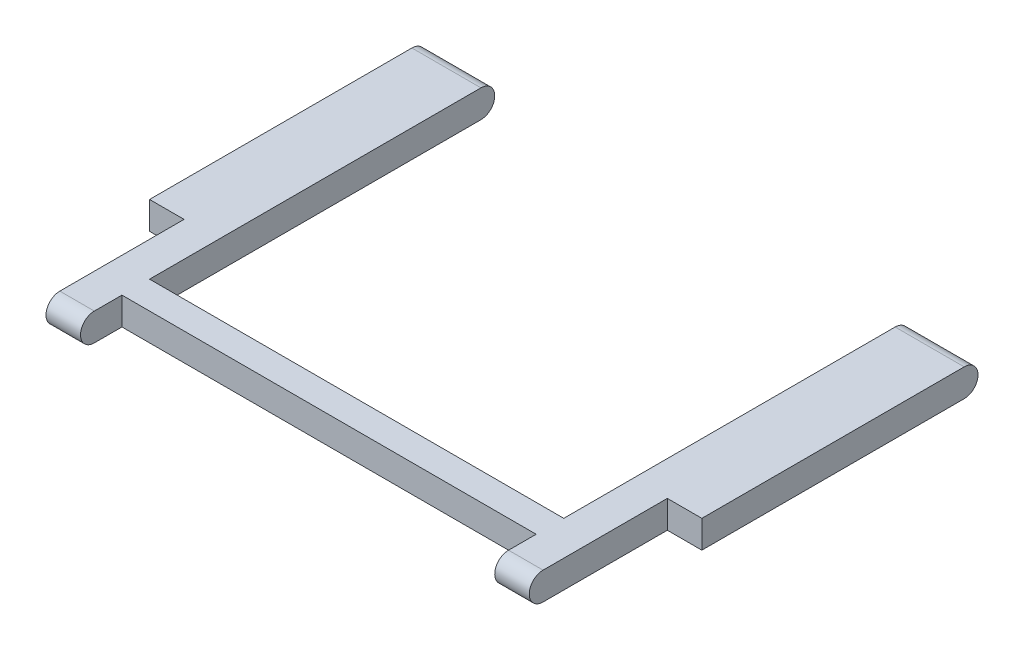
ISO-10303-21;
HEADER;
FILE_DESCRIPTION(('STEP AP214'),'2;1');
FILE_NAME('part.step','',(''),(''),'','','');
FILE_SCHEMA(('AUTOMOTIVE_DESIGN { 1 0 10303 214 1 1 1 1 }'));
ENDSEC;
DATA;
#1=APPLICATION_CONTEXT('core data for automotive mechanical design processes');
#2=APPLICATION_PROTOCOL_DEFINITION('international standard','automotive_design',2000,#1);
#3=PRODUCT_CONTEXT('',#1,'mechanical');
#4=PRODUCT('Part','Part','',(#3));
#5=PRODUCT_RELATED_PRODUCT_CATEGORY('part','',(#4));
#6=PRODUCT_DEFINITION_FORMATION('','',#4);
#7=PRODUCT_DEFINITION_CONTEXT('part definition',#1,'design');
#8=PRODUCT_DEFINITION('design','',#6,#7);
#9=PRODUCT_DEFINITION_SHAPE('','',#8);
#10=(LENGTH_UNIT() NAMED_UNIT(*) SI_UNIT(.MILLI.,.METRE.));
#11=(NAMED_UNIT(*) PLANE_ANGLE_UNIT() SI_UNIT($,.RADIAN.));
#12=(NAMED_UNIT(*) SI_UNIT($,.STERADIAN.) SOLID_ANGLE_UNIT());
#13=UNCERTAINTY_MEASURE_WITH_UNIT(LENGTH_MEASURE(1.E-05),#10,'distance_accuracy_value','');
#14=(GEOMETRIC_REPRESENTATION_CONTEXT(3) GLOBAL_UNCERTAINTY_ASSIGNED_CONTEXT((#13)) GLOBAL_UNIT_ASSIGNED_CONTEXT((#10,
#11,#12)) REPRESENTATION_CONTEXT('',''));
#15=CARTESIAN_POINT('',(0.,0.,0.));
#16=DIRECTION('',(0.,0.,1.));
#17=DIRECTION('',(1.,0.,0.));
#18=AXIS2_PLACEMENT_3D('',#15,#16,#17);
#19=CARTESIAN_POINT('',(80.,0.,28.));
#20=DIRECTION('',(-1.,0.,0.));
#21=DIRECTION('',(0.,0.,1.));
#22=AXIS2_PLACEMENT_3D('',#19,#20,#21);
#23=CYLINDRICAL_SURFACE('',#22,2.);
#24=DIRECTION('',(-1.,0.,0.));
#25=VECTOR('',#24,1.);
#26=CARTESIAN_POINT('',(80.,2.,28.));
#27=LINE('',#26,#25);
#28=CARTESIAN_POINT('',(10.,2.,28.));
#29=VERTEX_POINT('',#28);
#30=CARTESIAN_POINT('',(5.00000000000001,2.,28.));
#31=VERTEX_POINT('',#30);
#32=EDGE_CURVE('E246',#29,#31,#27,.T.);
#33=ORIENTED_EDGE('',*,*,#32,.T.);
#34=CARTESIAN_POINT('',(5.00000000000002,0.,28.));
#35=DIRECTION('',(1.,0.,0.));
#36=DIRECTION('',(0.,0.,-1.));
#37=AXIS2_PLACEMENT_3D('',#34,#35,#36);
#38=CIRCLE('',#37,2.);
#39=CARTESIAN_POINT('',(5.00000000000002,-2.,28.));
#40=VERTEX_POINT('',#39);
#41=EDGE_CURVE('E161',#31,#40,#38,.T.);
#42=ORIENTED_EDGE('',*,*,#41,.T.);
#43=DIRECTION('',(-1.,0.,0.));
#44=VECTOR('',#43,1.);
#45=CARTESIAN_POINT('',(80.,-2.,28.));
#46=LINE('',#45,#44);
#47=CARTESIAN_POINT('',(10.,-2.,28.));
#48=VERTEX_POINT('',#47);
#49=EDGE_CURVE('E262',#48,#40,#46,.T.);
#50=ORIENTED_EDGE('',*,*,#49,.F.);
#51=CARTESIAN_POINT('',(10.,0.,28.));
#52=DIRECTION('',(-1.,0.,0.));
#53=DIRECTION('',(0.,0.,1.));
#54=AXIS2_PLACEMENT_3D('',#51,#52,#53);
#55=CIRCLE('',#54,2.);
#56=EDGE_CURVE('E235',#48,#29,#55,.T.);
#57=ORIENTED_EDGE('',*,*,#56,.T.);
#58=EDGE_LOOP('',(#33,#42,#50,#57));
#59=FACE_BOUND('',#58,.T.);
#60=ADVANCED_FACE('F38',(#59),#23,.T.);
#61=CARTESIAN_POINT('',(80.,0.,-28.));
#62=DIRECTION('',(-1.,0.,0.));
#63=DIRECTION('',(0.,0.,1.));
#64=AXIS2_PLACEMENT_3D('',#61,#62,#63);
#65=CYLINDRICAL_SURFACE('',#64,2.);
#66=DIRECTION('',(-1.,0.,0.));
#67=VECTOR('',#66,1.);
#68=CARTESIAN_POINT('',(80.,2.00000000000001,-28.));
#69=LINE('',#68,#67);
#70=CARTESIAN_POINT('',(10.,2.00000000000001,-28.));
#71=VERTEX_POINT('',#70);
#72=CARTESIAN_POINT('',(0.,2.00000000000001,-28.));
#73=VERTEX_POINT('',#72);
#74=EDGE_CURVE('E254',#71,#73,#69,.T.);
#75=ORIENTED_EDGE('',*,*,#74,.F.);
#76=CARTESIAN_POINT('',(9.99999999999999,0.,-28.));
#77=DIRECTION('',(-1.,0.,0.));
#78=DIRECTION('',(0.,0.,1.));
#79=AXIS2_PLACEMENT_3D('',#76,#77,#78);
#80=CIRCLE('',#79,2.);
#81=CARTESIAN_POINT('',(9.99999999999999,-1.99999999999999,-28.));
#82=VERTEX_POINT('',#81);
#83=EDGE_CURVE('E217',#71,#82,#80,.T.);
#84=ORIENTED_EDGE('',*,*,#83,.T.);
#85=DIRECTION('',(-1.,0.,0.));
#86=VECTOR('',#85,1.);
#87=CARTESIAN_POINT('',(80.,-1.99999999999999,-28.));
#88=LINE('',#87,#86);
#89=CARTESIAN_POINT('',(0.,-1.99999999999999,-28.));
#90=VERTEX_POINT('',#89);
#91=EDGE_CURVE('E258',#82,#90,#88,.T.);
#92=ORIENTED_EDGE('',*,*,#91,.T.);
#93=CARTESIAN_POINT('',(0.,0.,-28.));
#94=DIRECTION('',(1.,0.,0.));
#95=DIRECTION('',(0.,0.,-1.));
#96=AXIS2_PLACEMENT_3D('',#93,#94,#95);
#97=CIRCLE('',#96,2.);
#98=EDGE_CURVE('E248',#90,#73,#97,.T.);
#99=ORIENTED_EDGE('',*,*,#98,.T.);
#100=EDGE_LOOP('',(#75,#84,#92,#99));
#101=FACE_BOUND('',#100,.T.);
#102=ADVANCED_FACE('F324',(#101),#65,.T.);
#103=CARTESIAN_POINT('',(75.,0.,28.));
#104=DIRECTION('',(-1.,0.,0.));
#105=DIRECTION('',(0.,0.,1.));
#106=AXIS2_PLACEMENT_3D('',#103,#104,#105);
#107=CIRCLE('',#106,2.);
#108=CARTESIAN_POINT('',(75.,-2.,28.));
#109=VERTEX_POINT('',#108);
#110=CARTESIAN_POINT('',(75.,2.,28.));
#111=VERTEX_POINT('',#110);
#112=EDGE_CURVE('E185',#109,#111,#107,.T.);
#113=ORIENTED_EDGE('',*,*,#112,.T.);
#114=CARTESIAN_POINT('',(70.,2.,28.));
#115=VERTEX_POINT('',#114);
#116=EDGE_CURVE('E252',#111,#115,#27,.T.);
#117=ORIENTED_EDGE('',*,*,#116,.T.);
#118=CARTESIAN_POINT('',(70.,0.,28.));
#119=DIRECTION('',(1.,0.,0.));
#120=DIRECTION('',(0.,0.,-1.));
#121=AXIS2_PLACEMENT_3D('',#118,#119,#120);
#122=CIRCLE('',#121,2.);
#123=CARTESIAN_POINT('',(70.,-2.,28.));
#124=VERTEX_POINT('',#123);
#125=EDGE_CURVE('E226',#115,#124,#122,.T.);
#126=ORIENTED_EDGE('',*,*,#125,.T.);
#127=EDGE_CURVE('E263',#109,#124,#46,.T.);
#128=ORIENTED_EDGE('',*,*,#127,.F.);
#129=EDGE_LOOP('',(#113,#117,#126,#128));
#130=FACE_BOUND('',#129,.T.);
#131=ADVANCED_FACE('F40',(#130),#23,.T.);
#132=CARTESIAN_POINT('',(80.,-2.,28.));
#133=DIRECTION('',(0.,1.,0.));
#134=DIRECTION('',(0.,0.,1.));
#135=AXIS2_PLACEMENT_3D('',#132,#133,#134);
#136=PLANE('',#135);
#137=DIRECTION('',(0.,0.,-1.));
#138=VECTOR('',#137,1.);
#139=CARTESIAN_POINT('',(5.00000000000002,-2.,28.));
#140=LINE('',#139,#138);
#141=CARTESIAN_POINT('',(5.00000000000001,-2.,10.));
#142=VERTEX_POINT('',#141);
#143=EDGE_CURVE('E187',#40,#142,#140,.T.);
#144=ORIENTED_EDGE('',*,*,#143,.T.);
#145=DIRECTION('',(-1.,0.,0.));
#146=VECTOR('',#145,1.);
#147=CARTESIAN_POINT('',(80.,-2.,9.99999999999999));
#148=LINE('',#147,#146);
#149=CARTESIAN_POINT('',(0.,-2.,10.));
#150=VERTEX_POINT('',#149);
#151=EDGE_CURVE('E153',#142,#150,#148,.T.);
#152=ORIENTED_EDGE('',*,*,#151,.T.);
#153=DIRECTION('',(0.,0.,-1.));
#154=VECTOR('',#153,1.);
#155=CARTESIAN_POINT('',(0.,-2.,28.));
#156=LINE('',#155,#154);
#157=EDGE_CURVE('E238',#150,#90,#156,.T.);
#158=ORIENTED_EDGE('',*,*,#157,.T.);
#159=ORIENTED_EDGE('',*,*,#91,.F.);
#160=DIRECTION('',(0.,0.,1.));
#161=VECTOR('',#160,1.);
#162=CARTESIAN_POINT('',(10.,-2.,28.));
#163=LINE('',#162,#161);
#164=CARTESIAN_POINT('',(10.,-2.,20.));
#165=VERTEX_POINT('',#164);
#166=EDGE_CURVE('E220',#82,#165,#163,.T.);
#167=ORIENTED_EDGE('',*,*,#166,.T.);
#168=DIRECTION('',(1.,0.,0.));
#169=VECTOR('',#168,1.);
#170=CARTESIAN_POINT('',(80.,-2.,20.));
#171=LINE('',#170,#169);
#172=CARTESIAN_POINT('',(70.,-2.,20.));
#173=VERTEX_POINT('',#172);
#174=EDGE_CURVE('E200',#165,#173,#171,.T.);
#175=ORIENTED_EDGE('',*,*,#174,.T.);
#176=DIRECTION('',(0.,0.,-1.));
#177=VECTOR('',#176,1.);
#178=CARTESIAN_POINT('',(70.,-2.,28.));
#179=LINE('',#178,#177);
#180=CARTESIAN_POINT('',(70.,-1.99999999999999,-28.));
#181=VERTEX_POINT('',#180);
#182=EDGE_CURVE('E214',#173,#181,#179,.T.);
#183=ORIENTED_EDGE('',*,*,#182,.T.);
#184=CARTESIAN_POINT('',(80.,-1.99999999999999,-28.));
#185=VERTEX_POINT('',#184);
#186=EDGE_CURVE('E259',#185,#181,#88,.T.);
#187=ORIENTED_EDGE('',*,*,#186,.F.);
#188=DIRECTION('',(0.,0.,-1.));
#189=VECTOR('',#188,1.);
#190=CARTESIAN_POINT('',(80.,-2.,28.));
#191=LINE('',#190,#189);
#192=CARTESIAN_POINT('',(80.,-2.,10.));
#193=VERTEX_POINT('',#192);
#194=EDGE_CURVE('E239',#193,#185,#191,.T.);
#195=ORIENTED_EDGE('',*,*,#194,.F.);
#196=DIRECTION('',(-1.,0.,0.));
#197=VECTOR('',#196,1.);
#198=CARTESIAN_POINT('',(80.,-2.,9.99999999999999));
#199=LINE('',#198,#197);
#200=CARTESIAN_POINT('',(75.,-2.,10.));
#201=VERTEX_POINT('',#200);
#202=EDGE_CURVE('E52',#193,#201,#199,.T.);
#203=ORIENTED_EDGE('',*,*,#202,.T.);
#204=DIRECTION('',(0.,0.,1.));
#205=VECTOR('',#204,1.);
#206=CARTESIAN_POINT('',(75.,-2.,28.));
#207=LINE('',#206,#205);
#208=EDGE_CURVE('E182',#201,#109,#207,.T.);
#209=ORIENTED_EDGE('',*,*,#208,.T.);
#210=ORIENTED_EDGE('',*,*,#127,.T.);
#211=DIRECTION('',(0.,0.,-1.));
#212=VECTOR('',#211,1.);
#213=CARTESIAN_POINT('',(70.,-2.,28.));
#214=LINE('',#213,#212);
#215=CARTESIAN_POINT('',(70.,-2.,24.));
#216=VERTEX_POINT('',#215);
#217=EDGE_CURVE('E223',#124,#216,#214,.T.);
#218=ORIENTED_EDGE('',*,*,#217,.T.);
#219=DIRECTION('',(-1.,0.,0.));
#220=VECTOR('',#219,1.);
#221=CARTESIAN_POINT('',(80.,-2.,24.));
#222=LINE('',#221,#220);
#223=CARTESIAN_POINT('',(10.,-2.,24.));
#224=VERTEX_POINT('',#223);
#225=EDGE_CURVE('E229',#216,#224,#222,.T.);
#226=ORIENTED_EDGE('',*,*,#225,.T.);
#227=DIRECTION('',(0.,0.,1.));
#228=VECTOR('',#227,1.);
#229=CARTESIAN_POINT('',(10.,-2.,28.));
#230=LINE('',#229,#228);
#231=EDGE_CURVE('E232',#224,#48,#230,.T.);
#232=ORIENTED_EDGE('',*,*,#231,.T.);
#233=ORIENTED_EDGE('',*,*,#49,.T.);
#234=EDGE_LOOP('',(#144,#152,#158,#159,#167,#175,#183,#187,#195,#203,#209,#210,#218,#226,#232,#233));
#235=FACE_BOUND('',#234,.T.);
#236=ADVANCED_FACE('F275',(#235),#136,.F.);
#237=ORIENTED_EDGE('',*,*,#186,.T.);
#238=CARTESIAN_POINT('',(70.,0.,-28.));
#239=DIRECTION('',(1.,0.,0.));
#240=DIRECTION('',(0.,0.,-1.));
#241=AXIS2_PLACEMENT_3D('',#238,#239,#240);
#242=CIRCLE('',#241,2.);
#243=CARTESIAN_POINT('',(70.,2.00000000000001,-28.));
#244=VERTEX_POINT('',#243);
#245=EDGE_CURVE('E211',#181,#244,#242,.T.);
#246=ORIENTED_EDGE('',*,*,#245,.T.);
#247=CARTESIAN_POINT('',(80.,2.00000000000001,-28.));
#248=VERTEX_POINT('',#247);
#249=EDGE_CURVE('E255',#248,#244,#69,.T.);
#250=ORIENTED_EDGE('',*,*,#249,.F.);
#251=CARTESIAN_POINT('',(80.,0.,-28.));
#252=DIRECTION('',(1.,0.,0.));
#253=DIRECTION('',(0.,0.,-1.));
#254=AXIS2_PLACEMENT_3D('',#251,#252,#253);
#255=CIRCLE('',#254,2.);
#256=EDGE_CURVE('E241',#185,#248,#255,.T.);
#257=ORIENTED_EDGE('',*,*,#256,.F.);
#258=EDGE_LOOP('',(#237,#246,#250,#257));
#259=FACE_BOUND('',#258,.T.);
#260=ADVANCED_FACE('F310',(#259),#65,.T.);
#261=CARTESIAN_POINT('',(80.,2.,28.));
#262=DIRECTION('',(0.,-1.,0.));
#263=DIRECTION('',(0.,0.,-1.));
#264=AXIS2_PLACEMENT_3D('',#261,#262,#263);
#265=PLANE('',#264);
#266=DIRECTION('',(0.,0.,1.));
#267=VECTOR('',#266,1.);
#268=CARTESIAN_POINT('',(0.,2.,28.));
#269=LINE('',#268,#267);
#270=CARTESIAN_POINT('',(0.,2.,10.));
#271=VERTEX_POINT('',#270);
#272=EDGE_CURVE('E170',#73,#271,#269,.T.);
#273=ORIENTED_EDGE('',*,*,#272,.T.);
#274=DIRECTION('',(-1.,0.,0.));
#275=VECTOR('',#274,1.);
#276=CARTESIAN_POINT('',(0.,2.,10.));
#277=LINE('',#276,#275);
#278=CARTESIAN_POINT('',(5.00000000000001,2.,10.));
#279=VERTEX_POINT('',#278);
#280=EDGE_CURVE('E60',#279,#271,#277,.T.);
#281=ORIENTED_EDGE('',*,*,#280,.F.);
#282=DIRECTION('',(0.,0.,-1.));
#283=VECTOR('',#282,1.);
#284=CARTESIAN_POINT('',(5.00000000000001,2.,30.));
#285=LINE('',#284,#283);
#286=EDGE_CURVE('E159',#31,#279,#285,.T.);
#287=ORIENTED_EDGE('',*,*,#286,.F.);
#288=ORIENTED_EDGE('',*,*,#32,.F.);
#289=DIRECTION('',(0.,0.,1.));
#290=VECTOR('',#289,1.);
#291=CARTESIAN_POINT('',(10.,2.,40.0549506934379));
#292=LINE('',#291,#290);
#293=CARTESIAN_POINT('',(10.,2.,24.));
#294=VERTEX_POINT('',#293);
#295=EDGE_CURVE('E191',#294,#29,#292,.T.);
#296=ORIENTED_EDGE('',*,*,#295,.F.);
#297=DIRECTION('',(-1.,0.,0.));
#298=VECTOR('',#297,1.);
#299=CARTESIAN_POINT('',(10.,2.,24.));
#300=LINE('',#299,#298);
#301=CARTESIAN_POINT('',(70.,2.,24.));
#302=VERTEX_POINT('',#301);
#303=EDGE_CURVE('E193',#302,#294,#300,.T.);
#304=ORIENTED_EDGE('',*,*,#303,.F.);
#305=DIRECTION('',(0.,0.,1.));
#306=VECTOR('',#305,1.);
#307=CARTESIAN_POINT('',(70.,2.,28.));
#308=LINE('',#307,#306);
#309=EDGE_CURVE('E268',#302,#115,#308,.T.);
#310=ORIENTED_EDGE('',*,*,#309,.T.);
#311=ORIENTED_EDGE('',*,*,#116,.F.);
#312=DIRECTION('',(0.,0.,1.));
#313=VECTOR('',#312,1.);
#314=CARTESIAN_POINT('',(75.,2.,30.));
#315=LINE('',#314,#313);
#316=CARTESIAN_POINT('',(75.,2.,10.));
#317=VERTEX_POINT('',#316);
#318=EDGE_CURVE('E176',#317,#111,#315,.T.);
#319=ORIENTED_EDGE('',*,*,#318,.F.);
#320=DIRECTION('',(-1.,0.,0.));
#321=VECTOR('',#320,1.);
#322=CARTESIAN_POINT('',(80.,2.,10.));
#323=LINE('',#322,#321);
#324=CARTESIAN_POINT('',(80.,2.,10.));
#325=VERTEX_POINT('',#324);
#326=EDGE_CURVE('E173',#325,#317,#323,.T.);
#327=ORIENTED_EDGE('',*,*,#326,.F.);
#328=DIRECTION('',(0.,0.,1.));
#329=VECTOR('',#328,1.);
#330=CARTESIAN_POINT('',(80.,2.,28.));
#331=LINE('',#330,#329);
#332=EDGE_CURVE('E243',#248,#325,#331,.T.);
#333=ORIENTED_EDGE('',*,*,#332,.F.);
#334=ORIENTED_EDGE('',*,*,#249,.T.);
#335=DIRECTION('',(0.,0.,-1.));
#336=VECTOR('',#335,1.);
#337=CARTESIAN_POINT('',(70.,2.00000000000001,-36.9603432624808));
#338=LINE('',#337,#336);
#339=CARTESIAN_POINT('',(70.,2.,20.));
#340=VERTEX_POINT('',#339);
#341=EDGE_CURVE('E204',#340,#244,#338,.T.);
#342=ORIENTED_EDGE('',*,*,#341,.F.);
#343=DIRECTION('',(1.,0.,0.));
#344=VECTOR('',#343,1.);
#345=CARTESIAN_POINT('',(10.,2.,20.));
#346=LINE('',#345,#344);
#347=CARTESIAN_POINT('',(10.,2.,20.));
#348=VERTEX_POINT('',#347);
#349=EDGE_CURVE('E190',#348,#340,#346,.T.);
#350=ORIENTED_EDGE('',*,*,#349,.F.);
#351=DIRECTION('',(0.,0.,-1.));
#352=VECTOR('',#351,1.);
#353=CARTESIAN_POINT('',(10.,2.,28.));
#354=LINE('',#353,#352);
#355=EDGE_CURVE('E265',#348,#71,#354,.T.);
#356=ORIENTED_EDGE('',*,*,#355,.T.);
#357=ORIENTED_EDGE('',*,*,#74,.T.);
#358=EDGE_LOOP('',(#273,#281,#287,#288,#296,#304,#310,#311,#319,#327,#333,#334,#342,#350,#356,#357));
#359=FACE_BOUND('',#358,.T.);
#360=ADVANCED_FACE('F168',(#359),#265,.F.);
#361=CARTESIAN_POINT('',(80.,0.,28.));
#362=DIRECTION('',(1.,0.,0.));
#363=DIRECTION('',(0.,0.,-1.));
#364=AXIS2_PLACEMENT_3D('',#361,#362,#363);
#365=PLANE('',#364);
#366=DIRECTION('',(0.,1.,0.));
#367=VECTOR('',#366,1.);
#368=CARTESIAN_POINT('',(80.,0.,9.99999999999999));
#369=LINE('',#368,#367);
#370=EDGE_CURVE('E11',#193,#325,#369,.T.);
#371=ORIENTED_EDGE('',*,*,#370,.F.);
#372=ORIENTED_EDGE('',*,*,#194,.T.);
#373=ORIENTED_EDGE('',*,*,#256,.T.);
#374=ORIENTED_EDGE('',*,*,#332,.T.);
#375=EDGE_LOOP('',(#371,#372,#373,#374));
#376=FACE_BOUND('',#375,.T.);
#377=ADVANCED_FACE('F304',(#376),#365,.T.);
#378=CARTESIAN_POINT('',(0.,0.,28.));
#379=DIRECTION('',(1.,0.,0.));
#380=DIRECTION('',(0.,0.,-1.));
#381=AXIS2_PLACEMENT_3D('',#378,#379,#380);
#382=PLANE('',#381);
#383=ORIENTED_EDGE('',*,*,#157,.F.);
#384=DIRECTION('',(0.,1.,0.));
#385=VECTOR('',#384,1.);
#386=CARTESIAN_POINT('',(0.,0.,9.99999999999999));
#387=LINE('',#386,#385);
#388=EDGE_CURVE('E46',#150,#271,#387,.T.);
#389=ORIENTED_EDGE('',*,*,#388,.T.);
#390=ORIENTED_EDGE('',*,*,#272,.F.);
#391=ORIENTED_EDGE('',*,*,#98,.F.);
#392=EDGE_LOOP('',(#383,#389,#390,#391));
#393=FACE_BOUND('',#392,.T.);
#394=ADVANCED_FACE('F272',(#393),#382,.F.);
#395=CARTESIAN_POINT('',(10.,-7.99999999999999,-36.9603432624808));
#396=DIRECTION('',(-1.,0.,0.));
#397=DIRECTION('',(0.,0.,1.));
#398=AXIS2_PLACEMENT_3D('',#395,#396,#397);
#399=PLANE('',#398);
#400=ORIENTED_EDGE('',*,*,#83,.F.);
#401=ORIENTED_EDGE('',*,*,#355,.F.);
#402=DIRECTION('',(0.,1.,0.));
#403=VECTOR('',#402,1.);
#404=CARTESIAN_POINT('',(10.,-8.,20.));
#405=LINE('',#404,#403);
#406=EDGE_CURVE('E206',#165,#348,#405,.T.);
#407=ORIENTED_EDGE('',*,*,#406,.F.);
#408=ORIENTED_EDGE('',*,*,#166,.F.);
#409=EDGE_LOOP('',(#400,#401,#407,#408));
#410=FACE_BOUND('',#409,.T.);
#411=ADVANCED_FACE('F321',(#410),#399,.F.);
#412=CARTESIAN_POINT('',(70.,-7.99999999999999,-36.9603432624808));
#413=DIRECTION('',(1.,0.,0.));
#414=DIRECTION('',(0.,0.,-1.));
#415=AXIS2_PLACEMENT_3D('',#412,#413,#414);
#416=PLANE('',#415);
#417=DIRECTION('',(0.,1.,0.));
#418=VECTOR('',#417,1.);
#419=CARTESIAN_POINT('',(70.,-8.,20.));
#420=LINE('',#419,#418);
#421=EDGE_CURVE('E194',#173,#340,#420,.T.);
#422=ORIENTED_EDGE('',*,*,#421,.T.);
#423=ORIENTED_EDGE('',*,*,#341,.T.);
#424=ORIENTED_EDGE('',*,*,#245,.F.);
#425=ORIENTED_EDGE('',*,*,#182,.F.);
#426=EDGE_LOOP('',(#422,#423,#424,#425));
#427=FACE_BOUND('',#426,.T.);
#428=ADVANCED_FACE('F314',(#427),#416,.F.);
#429=CARTESIAN_POINT('',(10.,-8.,20.));
#430=DIRECTION('',(0.,0.,1.));
#431=DIRECTION('',(0.,-1.,0.));
#432=AXIS2_PLACEMENT_3D('',#429,#430,#431);
#433=PLANE('',#432);
#434=ORIENTED_EDGE('',*,*,#406,.T.);
#435=ORIENTED_EDGE('',*,*,#349,.T.);
#436=ORIENTED_EDGE('',*,*,#421,.F.);
#437=ORIENTED_EDGE('',*,*,#174,.F.);
#438=EDGE_LOOP('',(#434,#435,#436,#437));
#439=FACE_BOUND('',#438,.T.);
#440=ADVANCED_FACE('F317',(#439),#433,.F.);
#441=CARTESIAN_POINT('',(10.,-8.,40.0549506934379));
#442=DIRECTION('',(-1.,0.,0.));
#443=DIRECTION('',(0.,0.,1.));
#444=AXIS2_PLACEMENT_3D('',#441,#442,#443);
#445=PLANE('',#444);
#446=ORIENTED_EDGE('',*,*,#231,.F.);
#447=DIRECTION('',(0.,1.,0.));
#448=VECTOR('',#447,1.);
#449=CARTESIAN_POINT('',(10.,-8.,24.));
#450=LINE('',#449,#448);
#451=EDGE_CURVE('E198',#224,#294,#450,.T.);
#452=ORIENTED_EDGE('',*,*,#451,.T.);
#453=ORIENTED_EDGE('',*,*,#295,.T.);
#454=ORIENTED_EDGE('',*,*,#56,.F.);
#455=EDGE_LOOP('',(#446,#452,#453,#454));
#456=FACE_BOUND('',#455,.T.);
#457=ADVANCED_FACE('F284',(#456),#445,.F.);
#458=CARTESIAN_POINT('',(10.,-8.,24.));
#459=DIRECTION('',(0.,0.,-1.));
#460=DIRECTION('',(0.,1.,0.));
#461=AXIS2_PLACEMENT_3D('',#458,#459,#460);
#462=PLANE('',#461);
#463=DIRECTION('',(0.,1.,0.));
#464=VECTOR('',#463,1.);
#465=CARTESIAN_POINT('',(70.,-8.,24.));
#466=LINE('',#465,#464);
#467=EDGE_CURVE('E197',#216,#302,#466,.T.);
#468=ORIENTED_EDGE('',*,*,#467,.T.);
#469=ORIENTED_EDGE('',*,*,#303,.T.);
#470=ORIENTED_EDGE('',*,*,#451,.F.);
#471=ORIENTED_EDGE('',*,*,#225,.F.);
#472=EDGE_LOOP('',(#468,#469,#470,#471));
#473=FACE_BOUND('',#472,.T.);
#474=ADVANCED_FACE('F287',(#473),#462,.F.);
#475=CARTESIAN_POINT('',(70.,-8.,40.0549506934379));
#476=DIRECTION('',(1.,0.,0.));
#477=DIRECTION('',(0.,0.,-1.));
#478=AXIS2_PLACEMENT_3D('',#475,#476,#477);
#479=PLANE('',#478);
#480=ORIENTED_EDGE('',*,*,#309,.F.);
#481=ORIENTED_EDGE('',*,*,#467,.F.);
#482=ORIENTED_EDGE('',*,*,#217,.F.);
#483=ORIENTED_EDGE('',*,*,#125,.F.);
#484=EDGE_LOOP('',(#480,#481,#482,#483));
#485=FACE_BOUND('',#484,.T.);
#486=ADVANCED_FACE('F293',(#485),#479,.F.);
#487=CARTESIAN_POINT('',(5.00000000000001,-8.,30.));
#488=DIRECTION('',(1.,0.,0.));
#489=DIRECTION('',(0.,0.,-1.));
#490=AXIS2_PLACEMENT_3D('',#487,#488,#489);
#491=PLANE('',#490);
#492=ORIENTED_EDGE('',*,*,#286,.T.);
#493=DIRECTION('',(0.,1.,0.));
#494=VECTOR('',#493,1.);
#495=CARTESIAN_POINT('',(5.00000000000001,-8.,10.));
#496=LINE('',#495,#494);
#497=EDGE_CURVE('E149',#142,#279,#496,.T.);
#498=ORIENTED_EDGE('',*,*,#497,.F.);
#499=ORIENTED_EDGE('',*,*,#143,.F.);
#500=ORIENTED_EDGE('',*,*,#41,.F.);
#501=EDGE_LOOP('',(#492,#498,#499,#500));
#502=FACE_BOUND('',#501,.T.);
#503=ADVANCED_FACE('F160',(#502),#491,.F.);
#504=CARTESIAN_POINT('',(0.,-8.,10.));
#505=DIRECTION('',(0.,0.,-1.));
#506=DIRECTION('',(0.,1.,0.));
#507=AXIS2_PLACEMENT_3D('',#504,#505,#506);
#508=PLANE('',#507);
#509=ORIENTED_EDGE('',*,*,#497,.T.);
#510=ORIENTED_EDGE('',*,*,#280,.T.);
#511=ORIENTED_EDGE('',*,*,#388,.F.);
#512=ORIENTED_EDGE('',*,*,#151,.F.);
#513=EDGE_LOOP('',(#509,#510,#511,#512));
#514=FACE_BOUND('',#513,.T.);
#515=ADVANCED_FACE('F151',(#514),#508,.F.);
#516=CARTESIAN_POINT('',(75.,-8.,30.));
#517=DIRECTION('',(-1.,0.,0.));
#518=DIRECTION('',(0.,0.,1.));
#519=AXIS2_PLACEMENT_3D('',#516,#517,#518);
#520=PLANE('',#519);
#521=ORIENTED_EDGE('',*,*,#112,.F.);
#522=ORIENTED_EDGE('',*,*,#208,.F.);
#523=DIRECTION('',(0.,1.,0.));
#524=VECTOR('',#523,1.);
#525=CARTESIAN_POINT('',(75.,-8.,10.));
#526=LINE('',#525,#524);
#527=EDGE_CURVE('E165',#201,#317,#526,.T.);
#528=ORIENTED_EDGE('',*,*,#527,.T.);
#529=ORIENTED_EDGE('',*,*,#318,.T.);
#530=EDGE_LOOP('',(#521,#522,#528,#529));
#531=FACE_BOUND('',#530,.T.);
#532=ADVANCED_FACE('F300',(#531),#520,.F.);
#533=CARTESIAN_POINT('',(80.,-8.,10.));
#534=DIRECTION('',(0.,0.,-1.));
#535=DIRECTION('',(0.,1.,0.));
#536=AXIS2_PLACEMENT_3D('',#533,#534,#535);
#537=PLANE('',#536);
#538=ORIENTED_EDGE('',*,*,#370,.T.);
#539=ORIENTED_EDGE('',*,*,#326,.T.);
#540=ORIENTED_EDGE('',*,*,#527,.F.);
#541=ORIENTED_EDGE('',*,*,#202,.F.);
#542=EDGE_LOOP('',(#538,#539,#540,#541));
#543=FACE_BOUND('',#542,.T.);
#544=ADVANCED_FACE('F301',(#543),#537,.F.);
#545=CLOSED_SHELL('',(#60,#102,#131,#236,#260,#360,#377,#394,#411,#428,#440,#457,#474,#486,#503,
#515,#532,#544));
#546=MANIFOLD_SOLID_BREP('B2',#545);
#547=ADVANCED_BREP_SHAPE_REPRESENTATION('',(#18,#546),#14);
#548=SHAPE_DEFINITION_REPRESENTATION(#9,#547);
ENDSEC;
END-ISO-10303-21;
